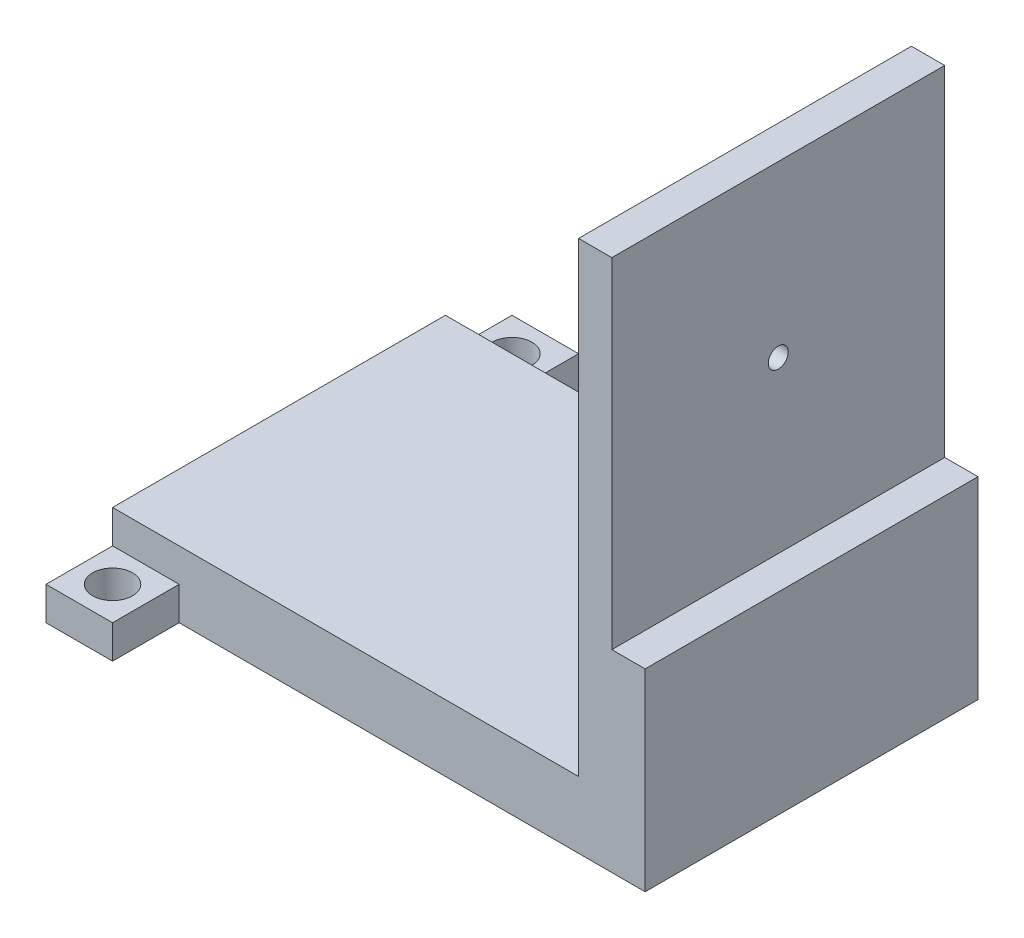
ISO-10303-21;
HEADER;
FILE_DESCRIPTION(('STEP AP214'),'2;1');
FILE_NAME('part.step','',(''),(''),'','','');
FILE_SCHEMA(('AUTOMOTIVE_DESIGN { 1 0 10303 214 1 1 1 1 }'));
ENDSEC;
DATA;
#1=APPLICATION_CONTEXT('core data for automotive mechanical design processes');
#2=APPLICATION_PROTOCOL_DEFINITION('international standard','automotive_design',2000,#1);
#3=PRODUCT_CONTEXT('',#1,'mechanical');
#4=PRODUCT('Part','Part','',(#3));
#5=PRODUCT_RELATED_PRODUCT_CATEGORY('part','',(#4));
#6=PRODUCT_DEFINITION_FORMATION('','',#4);
#7=PRODUCT_DEFINITION_CONTEXT('part definition',#1,'design');
#8=PRODUCT_DEFINITION('design','',#6,#7);
#9=PRODUCT_DEFINITION_SHAPE('','',#8);
#10=(LENGTH_UNIT() NAMED_UNIT(*) SI_UNIT(.MILLI.,.METRE.));
#11=(NAMED_UNIT(*) PLANE_ANGLE_UNIT() SI_UNIT($,.RADIAN.));
#12=(NAMED_UNIT(*) SI_UNIT($,.STERADIAN.) SOLID_ANGLE_UNIT());
#13=UNCERTAINTY_MEASURE_WITH_UNIT(LENGTH_MEASURE(1.E-05),#10,'distance_accuracy_value','');
#14=(GEOMETRIC_REPRESENTATION_CONTEXT(3) GLOBAL_UNCERTAINTY_ASSIGNED_CONTEXT((#13)) GLOBAL_UNIT_ASSIGNED_CONTEXT((#10,
#11,#12)) REPRESENTATION_CONTEXT('',''));
#15=CARTESIAN_POINT('',(0.,0.,0.));
#16=DIRECTION('',(0.,0.,1.));
#17=DIRECTION('',(1.,0.,0.));
#18=AXIS2_PLACEMENT_3D('',#15,#16,#17);
#19=CARTESIAN_POINT('',(-16.24,10.,-24.848));
#20=DIRECTION('',(-1.,0.,0.));
#21=DIRECTION('',(0.,0.,1.));
#22=AXIS2_PLACEMENT_3D('',#19,#20,#21);
#23=PLANE('',#22);
#24=DIRECTION('',(0.,0.,-1.));
#25=VECTOR('',#24,1.);
#26=CARTESIAN_POINT('',(-16.24,5.,-14.848));
#27=LINE('',#26,#25);
#28=CARTESIAN_POINT('',(-16.24,5.,-14.848));
#29=VERTEX_POINT('',#28);
#30=CARTESIAN_POINT('',(-16.24,5.,-24.848));
#31=VERTEX_POINT('',#30);
#32=EDGE_CURVE('E175',#29,#31,#27,.T.);
#33=ORIENTED_EDGE('',*,*,#32,.F.);
#34=DIRECTION('',(0.,-1.,0.));
#35=VECTOR('',#34,1.);
#36=CARTESIAN_POINT('',(-16.24,10.,-14.848));
#37=LINE('',#36,#35);
#38=CARTESIAN_POINT('',(-16.24,0.,-14.848));
#39=VERTEX_POINT('',#38);
#40=EDGE_CURVE('E188',#29,#39,#37,.T.);
#41=ORIENTED_EDGE('',*,*,#40,.T.);
#42=DIRECTION('',(0.,0.,1.));
#43=VECTOR('',#42,1.);
#44=CARTESIAN_POINT('',(-16.24,0.,-24.848));
#45=LINE('',#44,#43);
#46=CARTESIAN_POINT('',(-16.24,0.,-24.848));
#47=VERTEX_POINT('',#46);
#48=EDGE_CURVE('E197',#47,#39,#45,.T.);
#49=ORIENTED_EDGE('',*,*,#48,.F.);
#50=DIRECTION('',(0.,-1.,0.));
#51=VECTOR('',#50,1.);
#52=CARTESIAN_POINT('',(-16.24,10.,-24.848));
#53=LINE('',#52,#51);
#54=EDGE_CURVE('E192',#31,#47,#53,.T.);
#55=ORIENTED_EDGE('',*,*,#54,.F.);
#56=EDGE_LOOP('',(#33,#41,#49,#55));
#57=FACE_BOUND('',#56,.T.);
#58=ADVANCED_FACE('F38',(#57),#23,.F.);
#59=CARTESIAN_POINT('',(0.,0.,-24.848));
#60=DIRECTION('',(0.,0.,1.));
#61=DIRECTION('',(1.,0.,0.));
#62=AXIS2_PLACEMENT_3D('',#59,#60,#61);
#63=PLANE('',#62);
#64=DIRECTION('',(-1.,0.,0.));
#65=VECTOR('',#64,1.);
#66=CARTESIAN_POINT('',(-16.24,5.,-24.848));
#67=LINE('',#66,#65);
#68=CARTESIAN_POINT('',(-26.24,5.,-24.848));
#69=VERTEX_POINT('',#68);
#70=EDGE_CURVE('E179',#31,#69,#67,.T.);
#71=ORIENTED_EDGE('',*,*,#70,.F.);
#72=ORIENTED_EDGE('',*,*,#54,.T.);
#73=DIRECTION('',(-1.,0.,0.));
#74=VECTOR('',#73,1.);
#75=CARTESIAN_POINT('',(-26.24,0.,-24.848));
#76=LINE('',#75,#74);
#77=CARTESIAN_POINT('',(-26.24,0.,-24.848));
#78=VERTEX_POINT('',#77);
#79=EDGE_CURVE('E194',#47,#78,#76,.T.);
#80=ORIENTED_EDGE('',*,*,#79,.T.);
#81=DIRECTION('',(0.,1.,0.));
#82=VECTOR('',#81,1.);
#83=CARTESIAN_POINT('',(-26.24,10.,-24.848));
#84=LINE('',#83,#82);
#85=EDGE_CURVE('E189',#78,#69,#84,.T.);
#86=ORIENTED_EDGE('',*,*,#85,.T.);
#87=EDGE_LOOP('',(#71,#72,#80,#86));
#88=FACE_BOUND('',#87,.T.);
#89=ADVANCED_FACE('F309',(#88),#63,.F.);
#90=CARTESIAN_POINT('',(-26.24,10.,-14.848));
#91=DIRECTION('',(0.,0.,1.));
#92=DIRECTION('',(1.,0.,0.));
#93=AXIS2_PLACEMENT_3D('',#90,#91,#92);
#94=PLANE('',#93);
#95=DIRECTION('',(0.,1.,0.));
#96=VECTOR('',#95,1.);
#97=CARTESIAN_POINT('',(48.76,80.,-14.848));
#98=LINE('',#97,#96);
#99=CARTESIAN_POINT('',(48.76,29.,-14.848));
#100=VERTEX_POINT('',#99);
#101=CARTESIAN_POINT('',(48.76,80.,-14.848));
#102=VERTEX_POINT('',#101);
#103=EDGE_CURVE('E53',#100,#102,#98,.T.);
#104=ORIENTED_EDGE('',*,*,#103,.F.);
#105=DIRECTION('',(1.,0.,0.));
#106=VECTOR('',#105,1.);
#107=CARTESIAN_POINT('',(48.76,29.,-14.848));
#108=LINE('',#107,#106);
#109=CARTESIAN_POINT('',(53.76,29.,-14.848));
#110=VERTEX_POINT('',#109);
#111=EDGE_CURVE('E167',#100,#110,#108,.T.);
#112=ORIENTED_EDGE('',*,*,#111,.T.);
#113=DIRECTION('',(0.,-1.,0.));
#114=VECTOR('',#113,1.);
#115=CARTESIAN_POINT('',(53.76,10.,-14.848));
#116=LINE('',#115,#114);
#117=CARTESIAN_POINT('',(53.76,0.,-14.848));
#118=VERTEX_POINT('',#117);
#119=EDGE_CURVE('E46',#110,#118,#116,.T.);
#120=ORIENTED_EDGE('',*,*,#119,.T.);
#121=DIRECTION('',(-1.,0.,0.));
#122=VECTOR('',#121,1.);
#123=CARTESIAN_POINT('',(-26.24,0.,-14.848));
#124=LINE('',#123,#122);
#125=EDGE_CURVE('E237',#118,#39,#124,.T.);
#126=ORIENTED_EDGE('',*,*,#125,.T.);
#127=ORIENTED_EDGE('',*,*,#40,.F.);
#128=DIRECTION('',(1.,0.,0.));
#129=VECTOR('',#128,1.);
#130=CARTESIAN_POINT('',(-16.24,5.,-14.848));
#131=LINE('',#130,#129);
#132=CARTESIAN_POINT('',(-26.24,5.,-14.848));
#133=VERTEX_POINT('',#132);
#134=EDGE_CURVE('E183',#133,#29,#131,.T.);
#135=ORIENTED_EDGE('',*,*,#134,.F.);
#136=DIRECTION('',(0.,1.,0.));
#137=VECTOR('',#136,1.);
#138=CARTESIAN_POINT('',(-26.24,5.,-14.848));
#139=LINE('',#138,#137);
#140=CARTESIAN_POINT('',(-26.24,10.,-14.848));
#141=VERTEX_POINT('',#140);
#142=EDGE_CURVE('E185',#133,#141,#139,.T.);
#143=ORIENTED_EDGE('',*,*,#142,.T.);
#144=DIRECTION('',(-1.,0.,0.));
#145=VECTOR('',#144,1.);
#146=CARTESIAN_POINT('',(-26.24,10.,-14.848));
#147=LINE('',#146,#145);
#148=CARTESIAN_POINT('',(43.76,10.,-14.848));
#149=VERTEX_POINT('',#148);
#150=EDGE_CURVE('E239',#149,#141,#147,.T.);
#151=ORIENTED_EDGE('',*,*,#150,.F.);
#152=DIRECTION('',(0.,-1.,0.));
#153=VECTOR('',#152,1.);
#154=CARTESIAN_POINT('',(43.76,80.,-14.848));
#155=LINE('',#154,#153);
#156=CARTESIAN_POINT('',(43.76,80.,-14.848));
#157=VERTEX_POINT('',#156);
#158=EDGE_CURVE('E161',#157,#149,#155,.T.);
#159=ORIENTED_EDGE('',*,*,#158,.F.);
#160=DIRECTION('',(-1.,0.,0.));
#161=VECTOR('',#160,1.);
#162=CARTESIAN_POINT('',(53.76,80.,-14.848));
#163=LINE('',#162,#161);
#164=EDGE_CURVE('E163',#102,#157,#163,.T.);
#165=ORIENTED_EDGE('',*,*,#164,.F.);
#166=EDGE_LOOP('',(#104,#112,#120,#126,#127,#135,#143,#151,#159,#165));
#167=FACE_BOUND('',#166,.T.);
#168=ADVANCED_FACE('F253',(#167),#94,.F.);
#169=CARTESIAN_POINT('',(-26.24,10.,35.152));
#170=DIRECTION('',(0.,0.,-1.));
#171=DIRECTION('',(-1.,0.,0.));
#172=AXIS2_PLACEMENT_3D('',#169,#170,#171);
#173=PLANE('',#172);
#174=DIRECTION('',(0.,-1.,0.));
#175=VECTOR('',#174,1.);
#176=CARTESIAN_POINT('',(53.76,10.,35.152));
#177=LINE('',#176,#175);
#178=CARTESIAN_POINT('',(53.76,29.,35.152));
#179=VERTEX_POINT('',#178);
#180=CARTESIAN_POINT('',(53.76,0.,35.152));
#181=VERTEX_POINT('',#180);
#182=EDGE_CURVE('E11',#179,#181,#177,.T.);
#183=ORIENTED_EDGE('',*,*,#182,.F.);
#184=DIRECTION('',(1.,0.,0.));
#185=VECTOR('',#184,1.);
#186=CARTESIAN_POINT('',(48.76,29.,35.152));
#187=LINE('',#186,#185);
#188=CARTESIAN_POINT('',(48.76,29.,35.152));
#189=VERTEX_POINT('',#188);
#190=EDGE_CURVE('E152',#189,#179,#187,.T.);
#191=ORIENTED_EDGE('',*,*,#190,.F.);
#192=DIRECTION('',(0.,-1.,0.));
#193=VECTOR('',#192,1.);
#194=CARTESIAN_POINT('',(48.76,80.,35.152));
#195=LINE('',#194,#193);
#196=CARTESIAN_POINT('',(48.76,80.,35.152));
#197=VERTEX_POINT('',#196);
#198=EDGE_CURVE('E139',#197,#189,#195,.T.);
#199=ORIENTED_EDGE('',*,*,#198,.F.);
#200=DIRECTION('',(1.,0.,0.));
#201=VECTOR('',#200,1.);
#202=CARTESIAN_POINT('',(53.76,80.,35.152));
#203=LINE('',#202,#201);
#204=CARTESIAN_POINT('',(43.76,80.,35.152));
#205=VERTEX_POINT('',#204);
#206=EDGE_CURVE('E151',#205,#197,#203,.T.);
#207=ORIENTED_EDGE('',*,*,#206,.F.);
#208=DIRECTION('',(0.,-1.,0.));
#209=VECTOR('',#208,1.);
#210=CARTESIAN_POINT('',(43.76,80.,35.152));
#211=LINE('',#210,#209);
#212=CARTESIAN_POINT('',(43.76,10.,35.152));
#213=VERTEX_POINT('',#212);
#214=EDGE_CURVE('E159',#205,#213,#211,.T.);
#215=ORIENTED_EDGE('',*,*,#214,.T.);
#216=DIRECTION('',(1.,0.,0.));
#217=VECTOR('',#216,1.);
#218=CARTESIAN_POINT('',(-26.24,10.,35.152));
#219=LINE('',#218,#217);
#220=CARTESIAN_POINT('',(-26.24,10.,35.152));
#221=VERTEX_POINT('',#220);
#222=EDGE_CURVE('E236',#221,#213,#219,.T.);
#223=ORIENTED_EDGE('',*,*,#222,.F.);
#224=DIRECTION('',(0.,1.,0.));
#225=VECTOR('',#224,1.);
#226=CARTESIAN_POINT('',(-26.24,5.,35.152));
#227=LINE('',#226,#225);
#228=CARTESIAN_POINT('',(-26.24,5.,35.152));
#229=VERTEX_POINT('',#228);
#230=EDGE_CURVE('E217',#229,#221,#227,.T.);
#231=ORIENTED_EDGE('',*,*,#230,.F.);
#232=DIRECTION('',(-1.,0.,0.));
#233=VECTOR('',#232,1.);
#234=CARTESIAN_POINT('',(-16.24,5.,35.152));
#235=LINE('',#234,#233);
#236=CARTESIAN_POINT('',(-16.24,5.,35.152));
#237=VERTEX_POINT('',#236);
#238=EDGE_CURVE('E210',#237,#229,#235,.T.);
#239=ORIENTED_EDGE('',*,*,#238,.F.);
#240=DIRECTION('',(0.,1.,0.));
#241=VECTOR('',#240,1.);
#242=CARTESIAN_POINT('',(-16.24,10.,35.152));
#243=LINE('',#242,#241);
#244=CARTESIAN_POINT('',(-16.24,0.,35.152));
#245=VERTEX_POINT('',#244);
#246=EDGE_CURVE('E220',#245,#237,#243,.T.);
#247=ORIENTED_EDGE('',*,*,#246,.F.);
#248=DIRECTION('',(1.,0.,0.));
#249=VECTOR('',#248,1.);
#250=CARTESIAN_POINT('',(-26.24,0.,35.152));
#251=LINE('',#250,#249);
#252=EDGE_CURVE('E243',#245,#181,#251,.T.);
#253=ORIENTED_EDGE('',*,*,#252,.T.);
#254=EDGE_LOOP('',(#183,#191,#199,#207,#215,#223,#231,#239,#247,#253));
#255=FACE_BOUND('',#254,.T.);
#256=ADVANCED_FACE('F149',(#255),#173,.F.);
#257=CARTESIAN_POINT('',(-26.24,10.,-14.848));
#258=DIRECTION('',(1.,0.,0.));
#259=DIRECTION('',(0.,0.,-1.));
#260=AXIS2_PLACEMENT_3D('',#257,#258,#259);
#261=PLANE('',#260);
#262=DIRECTION('',(0.,0.,1.));
#263=VECTOR('',#262,1.);
#264=CARTESIAN_POINT('',(-26.24,10.,-14.848));
#265=LINE('',#264,#263);
#266=EDGE_CURVE('E234',#141,#221,#265,.T.);
#267=ORIENTED_EDGE('',*,*,#266,.F.);
#268=ORIENTED_EDGE('',*,*,#142,.F.);
#269=DIRECTION('',(0.,0.,1.));
#270=VECTOR('',#269,1.);
#271=CARTESIAN_POINT('',(-26.24,5.,-14.848));
#272=LINE('',#271,#270);
#273=EDGE_CURVE('E181',#69,#133,#272,.T.);
#274=ORIENTED_EDGE('',*,*,#273,.F.);
#275=ORIENTED_EDGE('',*,*,#85,.F.);
#276=DIRECTION('',(0.,0.,1.));
#277=VECTOR('',#276,1.);
#278=CARTESIAN_POINT('',(-26.24,0.,-14.848));
#279=LINE('',#278,#277);
#280=CARTESIAN_POINT('',(-26.24,0.,45.152));
#281=VERTEX_POINT('',#280);
#282=EDGE_CURVE('E233',#78,#281,#279,.T.);
#283=ORIENTED_EDGE('',*,*,#282,.T.);
#284=DIRECTION('',(0.,-1.,0.));
#285=VECTOR('',#284,1.);
#286=CARTESIAN_POINT('',(-26.24,10.,45.152));
#287=LINE('',#286,#285);
#288=CARTESIAN_POINT('',(-26.24,5.,45.152));
#289=VERTEX_POINT('',#288);
#290=EDGE_CURVE('E221',#289,#281,#287,.T.);
#291=ORIENTED_EDGE('',*,*,#290,.F.);
#292=DIRECTION('',(0.,0.,1.));
#293=VECTOR('',#292,1.);
#294=CARTESIAN_POINT('',(-26.24,5.,35.152));
#295=LINE('',#294,#293);
#296=EDGE_CURVE('E213',#229,#289,#295,.T.);
#297=ORIENTED_EDGE('',*,*,#296,.F.);
#298=ORIENTED_EDGE('',*,*,#230,.T.);
#299=EDGE_LOOP('',(#267,#268,#274,#275,#283,#291,#297,#298));
#300=FACE_BOUND('',#299,.T.);
#301=ADVANCED_FACE('F40',(#300),#261,.F.);
#302=CARTESIAN_POINT('',(53.76,10.,-14.848));
#303=DIRECTION('',(-1.,0.,0.));
#304=DIRECTION('',(0.,0.,1.));
#305=AXIS2_PLACEMENT_3D('',#302,#303,#304);
#306=PLANE('',#305);
#307=ORIENTED_EDGE('',*,*,#119,.F.);
#308=DIRECTION('',(0.,0.,-1.));
#309=VECTOR('',#308,1.);
#310=CARTESIAN_POINT('',(53.76,29.,-14.848));
#311=LINE('',#310,#309);
#312=EDGE_CURVE('E284',#179,#110,#311,.T.);
#313=ORIENTED_EDGE('',*,*,#312,.F.);
#314=ORIENTED_EDGE('',*,*,#182,.T.);
#315=DIRECTION('',(0.,0.,-1.));
#316=VECTOR('',#315,1.);
#317=CARTESIAN_POINT('',(53.76,0.,-14.848));
#318=LINE('',#317,#316);
#319=EDGE_CURVE('E246',#181,#118,#318,.T.);
#320=ORIENTED_EDGE('',*,*,#319,.T.);
#321=EDGE_LOOP('',(#307,#313,#314,#320));
#322=FACE_BOUND('',#321,.T.);
#323=ADVANCED_FACE('F259',(#322),#306,.F.);
#324=CARTESIAN_POINT('',(0.,10.,0.));
#325=DIRECTION('',(0.,1.,0.));
#326=DIRECTION('',(0.,0.,1.));
#327=AXIS2_PLACEMENT_3D('',#324,#325,#326);
#328=PLANE('',#327);
#329=DIRECTION('',(0.,0.,1.));
#330=VECTOR('',#329,1.);
#331=CARTESIAN_POINT('',(43.76,10.,-14.848));
#332=LINE('',#331,#330);
#333=EDGE_CURVE('E61',#149,#213,#332,.T.);
#334=ORIENTED_EDGE('',*,*,#333,.F.);
#335=ORIENTED_EDGE('',*,*,#150,.T.);
#336=ORIENTED_EDGE('',*,*,#266,.T.);
#337=ORIENTED_EDGE('',*,*,#222,.T.);
#338=EDGE_LOOP('',(#334,#335,#336,#337));
#339=FACE_BOUND('',#338,.T.);
#340=ADVANCED_FACE('F277',(#339),#328,.T.);
#341=CARTESIAN_POINT('',(0.,0.,0.));
#342=DIRECTION('',(0.,1.,0.));
#343=DIRECTION('',(0.,0.,1.));
#344=AXIS2_PLACEMENT_3D('',#341,#342,#343);
#345=PLANE('',#344);
#346=CARTESIAN_POINT('',(-21.24,0.,-19.848));
#347=DIRECTION('',(0.,1.,0.));
#348=DIRECTION('',(0.,0.,1.));
#349=AXIS2_PLACEMENT_3D('',#346,#347,#348);
#350=CIRCLE('',#349,3.);
#351=CARTESIAN_POINT('',(-21.24,0.,-16.848));
#352=VERTEX_POINT('',#351);
#353=EDGE_CURVE('E172',#352,#352,#350,.T.);
#354=ORIENTED_EDGE('',*,*,#353,.T.);
#355=EDGE_LOOP('',(#354));
#356=FACE_BOUND('',#355,.T.);
#357=CARTESIAN_POINT('',(-21.24,0.,40.152));
#358=DIRECTION('',(0.,1.,0.));
#359=DIRECTION('',(0.,0.,1.));
#360=AXIS2_PLACEMENT_3D('',#357,#358,#359);
#361=CIRCLE('',#360,3.);
#362=CARTESIAN_POINT('',(-21.24,0.,43.152));
#363=VERTEX_POINT('',#362);
#364=EDGE_CURVE('E202',#363,#363,#361,.T.);
#365=ORIENTED_EDGE('',*,*,#364,.T.);
#366=EDGE_LOOP('',(#365));
#367=FACE_BOUND('',#366,.T.);
#368=ORIENTED_EDGE('',*,*,#282,.F.);
#369=ORIENTED_EDGE('',*,*,#79,.F.);
#370=ORIENTED_EDGE('',*,*,#48,.T.);
#371=ORIENTED_EDGE('',*,*,#125,.F.);
#372=ORIENTED_EDGE('',*,*,#319,.F.);
#373=ORIENTED_EDGE('',*,*,#252,.F.);
#374=DIRECTION('',(0.,0.,-1.));
#375=VECTOR('',#374,1.);
#376=CARTESIAN_POINT('',(-16.24,0.,45.152));
#377=LINE('',#376,#375);
#378=CARTESIAN_POINT('',(-16.24,0.,45.152));
#379=VERTEX_POINT('',#378);
#380=EDGE_CURVE('E228',#379,#245,#377,.T.);
#381=ORIENTED_EDGE('',*,*,#380,.F.);
#382=DIRECTION('',(1.,0.,0.));
#383=VECTOR('',#382,1.);
#384=CARTESIAN_POINT('',(-26.24,0.,45.152));
#385=LINE('',#384,#383);
#386=EDGE_CURVE('E223',#281,#379,#385,.T.);
#387=ORIENTED_EDGE('',*,*,#386,.F.);
#388=EDGE_LOOP('',(#368,#369,#370,#371,#372,#373,#381,#387));
#389=FACE_BOUND('',#388,.T.);
#390=ADVANCED_FACE('F262',(#356,#367,#389),#345,.F.);
#391=CARTESIAN_POINT('',(-16.24,10.,45.152));
#392=DIRECTION('',(-1.,0.,0.));
#393=DIRECTION('',(0.,0.,1.));
#394=AXIS2_PLACEMENT_3D('',#391,#392,#393);
#395=PLANE('',#394);
#396=ORIENTED_EDGE('',*,*,#246,.T.);
#397=DIRECTION('',(0.,0.,-1.));
#398=VECTOR('',#397,1.);
#399=CARTESIAN_POINT('',(-16.24,5.,35.152));
#400=LINE('',#399,#398);
#401=CARTESIAN_POINT('',(-16.24,5.,45.152));
#402=VERTEX_POINT('',#401);
#403=EDGE_CURVE('E205',#402,#237,#400,.T.);
#404=ORIENTED_EDGE('',*,*,#403,.F.);
#405=DIRECTION('',(0.,1.,0.));
#406=VECTOR('',#405,1.);
#407=CARTESIAN_POINT('',(-16.24,10.,45.152));
#408=LINE('',#407,#406);
#409=EDGE_CURVE('E225',#379,#402,#408,.T.);
#410=ORIENTED_EDGE('',*,*,#409,.F.);
#411=ORIENTED_EDGE('',*,*,#380,.T.);
#412=EDGE_LOOP('',(#396,#404,#410,#411));
#413=FACE_BOUND('',#412,.T.);
#414=ADVANCED_FACE('F331',(#413),#395,.F.);
#415=CARTESIAN_POINT('',(0.,0.,45.152));
#416=DIRECTION('',(0.,0.,1.));
#417=DIRECTION('',(1.,0.,0.));
#418=AXIS2_PLACEMENT_3D('',#415,#416,#417);
#419=PLANE('',#418);
#420=DIRECTION('',(1.,0.,0.));
#421=VECTOR('',#420,1.);
#422=CARTESIAN_POINT('',(-16.24,5.,45.152));
#423=LINE('',#422,#421);
#424=EDGE_CURVE('E215',#289,#402,#423,.T.);
#425=ORIENTED_EDGE('',*,*,#424,.F.);
#426=ORIENTED_EDGE('',*,*,#290,.T.);
#427=ORIENTED_EDGE('',*,*,#386,.T.);
#428=ORIENTED_EDGE('',*,*,#409,.T.);
#429=EDGE_LOOP('',(#425,#426,#427,#428));
#430=FACE_BOUND('',#429,.T.);
#431=ADVANCED_FACE('F327',(#430),#419,.T.);
#432=CARTESIAN_POINT('',(0.,5.,0.));
#433=DIRECTION('',(0.,-1.,0.));
#434=DIRECTION('',(0.,0.,-1.));
#435=AXIS2_PLACEMENT_3D('',#432,#433,#434);
#436=PLANE('',#435);
#437=CARTESIAN_POINT('',(-21.24,5.,40.152));
#438=DIRECTION('',(0.,1.,0.));
#439=DIRECTION('',(0.,0.,1.));
#440=AXIS2_PLACEMENT_3D('',#437,#438,#439);
#441=CIRCLE('',#440,3.);
#442=CARTESIAN_POINT('',(-21.24,5.,43.152));
#443=VERTEX_POINT('',#442);
#444=EDGE_CURVE('E201',#443,#443,#441,.T.);
#445=ORIENTED_EDGE('',*,*,#444,.F.);
#446=EDGE_LOOP('',(#445));
#447=FACE_BOUND('',#446,.T.);
#448=ORIENTED_EDGE('',*,*,#403,.T.);
#449=ORIENTED_EDGE('',*,*,#238,.T.);
#450=ORIENTED_EDGE('',*,*,#296,.T.);
#451=ORIENTED_EDGE('',*,*,#424,.T.);
#452=EDGE_LOOP('',(#448,#449,#450,#451));
#453=FACE_BOUND('',#452,.T.);
#454=ADVANCED_FACE('F323',(#447,#453),#436,.F.);
#455=CARTESIAN_POINT('',(-21.24,0.,40.152));
#456=DIRECTION('',(0.,1.,0.));
#457=DIRECTION('',(0.,0.,1.));
#458=AXIS2_PLACEMENT_3D('',#455,#456,#457);
#459=CYLINDRICAL_SURFACE('',#458,3.);
#460=ORIENTED_EDGE('',*,*,#364,.F.);
#461=EDGE_LOOP('',(#460));
#462=FACE_BOUND('',#461,.T.);
#463=ORIENTED_EDGE('',*,*,#444,.T.);
#464=EDGE_LOOP('',(#463));
#465=FACE_BOUND('',#464,.T.);
#466=ADVANCED_FACE('F319',(#462,#465),#459,.F.);
#467=CARTESIAN_POINT('',(0.,5.,0.));
#468=DIRECTION('',(0.,1.,0.));
#469=DIRECTION('',(0.,0.,1.));
#470=AXIS2_PLACEMENT_3D('',#467,#468,#469);
#471=PLANE('',#470);
#472=CARTESIAN_POINT('',(-21.24,5.,-19.848));
#473=DIRECTION('',(0.,1.,0.));
#474=DIRECTION('',(0.,0.,1.));
#475=AXIS2_PLACEMENT_3D('',#472,#473,#474);
#476=CIRCLE('',#475,3.);
#477=CARTESIAN_POINT('',(-21.24,5.,-16.848));
#478=VERTEX_POINT('',#477);
#479=EDGE_CURVE('E171',#478,#478,#476,.T.);
#480=ORIENTED_EDGE('',*,*,#479,.F.);
#481=EDGE_LOOP('',(#480));
#482=FACE_BOUND('',#481,.T.);
#483=ORIENTED_EDGE('',*,*,#32,.T.);
#484=ORIENTED_EDGE('',*,*,#70,.T.);
#485=ORIENTED_EDGE('',*,*,#273,.T.);
#486=ORIENTED_EDGE('',*,*,#134,.T.);
#487=EDGE_LOOP('',(#483,#484,#485,#486));
#488=FACE_BOUND('',#487,.T.);
#489=ADVANCED_FACE('F322',(#482,#488),#471,.T.);
#490=CARTESIAN_POINT('',(-21.24,0.,-19.848));
#491=DIRECTION('',(0.,1.,0.));
#492=DIRECTION('',(0.,0.,1.));
#493=AXIS2_PLACEMENT_3D('',#490,#491,#492);
#494=CYLINDRICAL_SURFACE('',#493,3.);
#495=ORIENTED_EDGE('',*,*,#353,.F.);
#496=EDGE_LOOP('',(#495));
#497=FACE_BOUND('',#496,.T.);
#498=ORIENTED_EDGE('',*,*,#479,.T.);
#499=EDGE_LOOP('',(#498));
#500=FACE_BOUND('',#499,.T.);
#501=ADVANCED_FACE('F365',(#497,#500),#494,.F.);
#502=CARTESIAN_POINT('',(43.76,80.,-14.848));
#503=DIRECTION('',(1.,0.,0.));
#504=DIRECTION('',(0.,0.,-1.));
#505=AXIS2_PLACEMENT_3D('',#502,#503,#504);
#506=PLANE('',#505);
#507=CARTESIAN_POINT('',(43.76,54.5,10.152));
#508=DIRECTION('',(1.,0.,0.));
#509=DIRECTION('',(0.,0.,-1.));
#510=AXIS2_PLACEMENT_3D('',#507,#508,#509);
#511=CIRCLE('',#510,1.5);
#512=CARTESIAN_POINT('',(43.76,54.5,8.65199999999999));
#513=VERTEX_POINT('',#512);
#514=EDGE_CURVE('E286',#513,#513,#511,.T.);
#515=ORIENTED_EDGE('',*,*,#514,.T.);
#516=EDGE_LOOP('',(#515));
#517=FACE_BOUND('',#516,.T.);
#518=ORIENTED_EDGE('',*,*,#333,.T.);
#519=ORIENTED_EDGE('',*,*,#214,.F.);
#520=DIRECTION('',(0.,0.,1.));
#521=VECTOR('',#520,1.);
#522=CARTESIAN_POINT('',(43.76,80.,-14.848));
#523=LINE('',#522,#521);
#524=EDGE_CURVE('E157',#157,#205,#523,.T.);
#525=ORIENTED_EDGE('',*,*,#524,.F.);
#526=ORIENTED_EDGE('',*,*,#158,.T.);
#527=EDGE_LOOP('',(#518,#519,#525,#526));
#528=FACE_BOUND('',#527,.T.);
#529=ADVANCED_FACE('F279',(#517,#528),#506,.F.);
#530=CARTESIAN_POINT('',(0.,80.,0.));
#531=DIRECTION('',(0.,-1.,0.));
#532=DIRECTION('',(0.,0.,-1.));
#533=AXIS2_PLACEMENT_3D('',#530,#531,#532);
#534=PLANE('',#533);
#535=ORIENTED_EDGE('',*,*,#206,.T.);
#536=DIRECTION('',(0.,0.,1.));
#537=VECTOR('',#536,1.);
#538=CARTESIAN_POINT('',(48.76,80.,-14.848));
#539=LINE('',#538,#537);
#540=EDGE_CURVE('E136',#102,#197,#539,.T.);
#541=ORIENTED_EDGE('',*,*,#540,.F.);
#542=ORIENTED_EDGE('',*,*,#164,.T.);
#543=ORIENTED_EDGE('',*,*,#524,.T.);
#544=EDGE_LOOP('',(#535,#541,#542,#543));
#545=FACE_BOUND('',#544,.T.);
#546=ADVANCED_FACE('F155',(#545),#534,.F.);
#547=CARTESIAN_POINT('',(48.76,29.,-14.848));
#548=DIRECTION('',(0.,-1.,0.));
#549=DIRECTION('',(0.,0.,-1.));
#550=AXIS2_PLACEMENT_3D('',#547,#548,#549);
#551=PLANE('',#550);
#552=ORIENTED_EDGE('',*,*,#312,.T.);
#553=ORIENTED_EDGE('',*,*,#111,.F.);
#554=DIRECTION('',(0.,0.,-1.));
#555=VECTOR('',#554,1.);
#556=CARTESIAN_POINT('',(48.76,29.,-14.848));
#557=LINE('',#556,#555);
#558=EDGE_CURVE('E153',#189,#100,#557,.T.);
#559=ORIENTED_EDGE('',*,*,#558,.F.);
#560=ORIENTED_EDGE('',*,*,#190,.T.);
#561=EDGE_LOOP('',(#552,#553,#559,#560));
#562=FACE_BOUND('',#561,.T.);
#563=ADVANCED_FACE('F299',(#562),#551,.F.);
#564=CARTESIAN_POINT('',(48.76,0.,0.));
#565=DIRECTION('',(-1.,0.,0.));
#566=DIRECTION('',(0.,0.,1.));
#567=AXIS2_PLACEMENT_3D('',#564,#565,#566);
#568=PLANE('',#567);
#569=CARTESIAN_POINT('',(48.76,54.5,10.152));
#570=DIRECTION('',(1.,0.,0.));
#571=DIRECTION('',(0.,0.,-1.));
#572=AXIS2_PLACEMENT_3D('',#569,#570,#571);
#573=CIRCLE('',#572,1.5);
#574=CARTESIAN_POINT('',(48.76,54.5,8.652));
#575=VERTEX_POINT('',#574);
#576=EDGE_CURVE('E291',#575,#575,#573,.T.);
#577=ORIENTED_EDGE('',*,*,#576,.F.);
#578=EDGE_LOOP('',(#577));
#579=FACE_BOUND('',#578,.T.);
#580=ORIENTED_EDGE('',*,*,#103,.T.);
#581=ORIENTED_EDGE('',*,*,#540,.T.);
#582=ORIENTED_EDGE('',*,*,#198,.T.);
#583=ORIENTED_EDGE('',*,*,#558,.T.);
#584=EDGE_LOOP('',(#580,#581,#582,#583));
#585=FACE_BOUND('',#584,.T.);
#586=ADVANCED_FACE('F138',(#579,#585),#568,.F.);
#587=CARTESIAN_POINT('',(38.76,54.5,10.152));
#588=DIRECTION('',(1.,0.,0.));
#589=DIRECTION('',(0.,0.,-1.));
#590=AXIS2_PLACEMENT_3D('',#587,#588,#589);
#591=CYLINDRICAL_SURFACE('',#590,1.5);
#592=ORIENTED_EDGE('',*,*,#576,.T.);
#593=EDGE_LOOP('',(#592));
#594=FACE_BOUND('',#593,.T.);
#595=ORIENTED_EDGE('',*,*,#514,.F.);
#596=EDGE_LOOP('',(#595));
#597=FACE_BOUND('',#596,.T.);
#598=ADVANCED_FACE('F295',(#594,#597),#591,.F.);
#599=CLOSED_SHELL('',(#58,#89,#168,#256,#301,#323,#340,#390,#414,#431,#454,#466,#489,#501,#529,
#546,#563,#586,#598));
#600=MANIFOLD_SOLID_BREP('B2',#599);
#601=ADVANCED_BREP_SHAPE_REPRESENTATION('',(#18,#600),#14);
#602=SHAPE_DEFINITION_REPRESENTATION(#9,#601);
ENDSEC;
END-ISO-10303-21;
